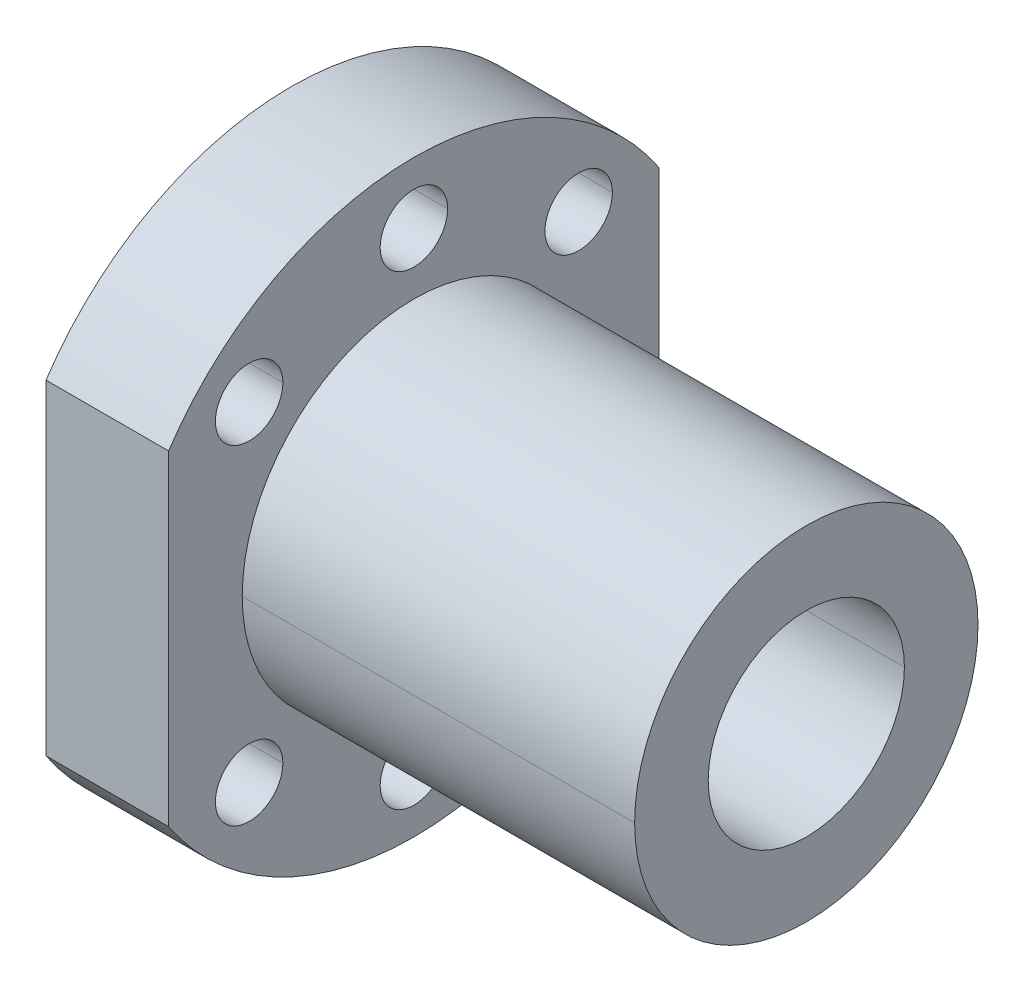
ISO-10303-21;
HEADER;
FILE_DESCRIPTION(('STEP AP214'),'2;1');
FILE_NAME('part.step','',(''),(''),'','','');
FILE_SCHEMA(('AUTOMOTIVE_DESIGN { 1 0 10303 214 1 1 1 1 }'));
ENDSEC;
DATA;
#1=APPLICATION_CONTEXT('core data for automotive mechanical design processes');
#2=APPLICATION_PROTOCOL_DEFINITION('international standard','automotive_design',2000,#1);
#3=PRODUCT_CONTEXT('',#1,'mechanical');
#4=PRODUCT('Part','Part','',(#3));
#5=PRODUCT_RELATED_PRODUCT_CATEGORY('part','',(#4));
#6=PRODUCT_DEFINITION_FORMATION('','',#4);
#7=PRODUCT_DEFINITION_CONTEXT('part definition',#1,'design');
#8=PRODUCT_DEFINITION('design','',#6,#7);
#9=PRODUCT_DEFINITION_SHAPE('','',#8);
#10=(LENGTH_UNIT() NAMED_UNIT(*) SI_UNIT(.MILLI.,.METRE.));
#11=(NAMED_UNIT(*) PLANE_ANGLE_UNIT() SI_UNIT($,.RADIAN.));
#12=(NAMED_UNIT(*) SI_UNIT($,.STERADIAN.) SOLID_ANGLE_UNIT());
#13=UNCERTAINTY_MEASURE_WITH_UNIT(LENGTH_MEASURE(1.E-05),#10,'distance_accuracy_value','');
#14=(GEOMETRIC_REPRESENTATION_CONTEXT(3) GLOBAL_UNCERTAINTY_ASSIGNED_CONTEXT((#13)) GLOBAL_UNIT_ASSIGNED_CONTEXT((#10,
#11,#12)) REPRESENTATION_CONTEXT('',''));
#15=CARTESIAN_POINT('',(0.,0.,0.));
#16=DIRECTION('',(0.,0.,1.));
#17=DIRECTION('',(1.,0.,0.));
#18=AXIS2_PLACEMENT_3D('',#15,#16,#17);
#19=CARTESIAN_POINT('',(42.,0.,0.));
#20=DIRECTION('',(1.,0.,0.));
#21=DIRECTION('',(0.,1.,0.));
#22=AXIS2_PLACEMENT_3D('',#19,#20,#21);
#23=PLANE('',#22);
#24=CARTESIAN_POINT('',(42.,0.,0.));
#25=DIRECTION('',(1.,0.,0.));
#26=DIRECTION('',(0.,0.,-1.));
#27=AXIS2_PLACEMENT_3D('',#24,#25,#26);
#28=CIRCLE('',#27,8.);
#29=CARTESIAN_POINT('',(42.,0.,-8.));
#30=VERTEX_POINT('',#29);
#31=CARTESIAN_POINT('',(42.,0.,8.));
#32=VERTEX_POINT('',#31);
#33=EDGE_CURVE('E9',#30,#32,#28,.T.);
#34=ORIENTED_EDGE('',*,*,#33,.F.);
#35=CARTESIAN_POINT('',(42.,0.,0.));
#36=DIRECTION('',(1.,0.,0.));
#37=DIRECTION('',(0.,0.,-1.));
#38=AXIS2_PLACEMENT_3D('',#35,#36,#37);
#39=CIRCLE('',#38,8.);
#40=EDGE_CURVE('E436',#32,#30,#39,.T.);
#41=ORIENTED_EDGE('',*,*,#40,.F.);
#42=EDGE_LOOP('',(#34,#41));
#43=FACE_BOUND('',#42,.T.);
#44=CARTESIAN_POINT('',(42.,0.,0.));
#45=DIRECTION('',(1.,0.,0.));
#46=DIRECTION('',(0.,0.,-1.));
#47=AXIS2_PLACEMENT_3D('',#44,#45,#46);
#48=CIRCLE('',#47,14.);
#49=CARTESIAN_POINT('',(42.,0.,14.));
#50=VERTEX_POINT('',#49);
#51=CARTESIAN_POINT('',(42.,0.,-14.));
#52=VERTEX_POINT('',#51);
#53=EDGE_CURVE('E317',#50,#52,#48,.T.);
#54=ORIENTED_EDGE('',*,*,#53,.T.);
#55=CARTESIAN_POINT('',(42.,0.,0.));
#56=DIRECTION('',(1.,0.,0.));
#57=DIRECTION('',(0.,0.,-1.));
#58=AXIS2_PLACEMENT_3D('',#55,#56,#57);
#59=CIRCLE('',#58,14.);
#60=EDGE_CURVE('E353',#52,#50,#59,.T.);
#61=ORIENTED_EDGE('',*,*,#60,.T.);
#62=EDGE_LOOP('',(#54,#61));
#63=FACE_BOUND('',#62,.T.);
#64=ADVANCED_FACE('F14',(#43,#63),#23,.T.);
#65=CARTESIAN_POINT('',(0.,0.,0.));
#66=DIRECTION('',(1.,0.,0.));
#67=DIRECTION('',(0.,0.,-1.));
#68=AXIS2_PLACEMENT_3D('',#65,#66,#67);
#69=CYLINDRICAL_SURFACE('',#68,8.);
#70=DIRECTION('',(1.,0.,0.));
#71=VECTOR('',#70,1.);
#72=CARTESIAN_POINT('',(0.,0.,8.));
#73=LINE('',#72,#71);
#74=CARTESIAN_POINT('',(0.,0.,8.));
#75=VERTEX_POINT('',#74);
#76=EDGE_CURVE('E301',#75,#32,#73,.T.);
#77=ORIENTED_EDGE('',*,*,#76,.F.);
#78=CARTESIAN_POINT('',(0.,0.,0.));
#79=DIRECTION('',(1.,0.,0.));
#80=DIRECTION('',(0.,0.,-1.));
#81=AXIS2_PLACEMENT_3D('',#78,#79,#80);
#82=CIRCLE('',#81,8.);
#83=CARTESIAN_POINT('',(0.,0.,-8.));
#84=VERTEX_POINT('',#83);
#85=EDGE_CURVE('E354',#84,#75,#82,.T.);
#86=ORIENTED_EDGE('',*,*,#85,.F.);
#87=DIRECTION('',(1.,0.,0.));
#88=VECTOR('',#87,1.);
#89=CARTESIAN_POINT('',(0.,0.,-8.));
#90=LINE('',#89,#88);
#91=EDGE_CURVE('E24',#84,#30,#90,.T.);
#92=ORIENTED_EDGE('',*,*,#91,.T.);
#93=ORIENTED_EDGE('',*,*,#33,.T.);
#94=EDGE_LOOP('',(#77,#86,#92,#93));
#95=FACE_BOUND('',#94,.T.);
#96=ADVANCED_FACE('F468',(#95),#69,.F.);
#97=CARTESIAN_POINT('',(0.,0.,0.));
#98=DIRECTION('',(1.,0.,0.));
#99=DIRECTION('',(0.,0.,-1.));
#100=AXIS2_PLACEMENT_3D('',#97,#98,#99);
#101=CYLINDRICAL_SURFACE('',#100,8.);
#102=CARTESIAN_POINT('',(0.,0.,0.));
#103=DIRECTION('',(1.,0.,0.));
#104=DIRECTION('',(0.,0.,-1.));
#105=AXIS2_PLACEMENT_3D('',#102,#103,#104);
#106=CIRCLE('',#105,8.);
#107=EDGE_CURVE('E358',#75,#84,#106,.T.);
#108=ORIENTED_EDGE('',*,*,#107,.F.);
#109=ORIENTED_EDGE('',*,*,#76,.T.);
#110=ORIENTED_EDGE('',*,*,#40,.T.);
#111=ORIENTED_EDGE('',*,*,#91,.F.);
#112=EDGE_LOOP('',(#108,#109,#110,#111));
#113=FACE_BOUND('',#112,.T.);
#114=ADVANCED_FACE('F466',(#113),#101,.F.);
#115=CARTESIAN_POINT('',(0.,-13.4350288425445,13.4350288425443));
#116=DIRECTION('',(1.,0.,0.));
#117=DIRECTION('',(0.,0.,-1.));
#118=AXIS2_PLACEMENT_3D('',#115,#116,#117);
#119=CYLINDRICAL_SURFACE('',#118,2.75);
#120=DIRECTION('',(1.,0.,0.));
#121=VECTOR('',#120,1.);
#122=CARTESIAN_POINT('',(0.,-13.4350288425445,16.1850288425444));
#123=LINE('',#122,#121);
#124=CARTESIAN_POINT('',(0.,-13.4350288425445,16.1850288425444));
#125=VERTEX_POINT('',#124);
#126=CARTESIAN_POINT('',(10.,-13.4350288425445,16.1850288425444));
#127=VERTEX_POINT('',#126);
#128=EDGE_CURVE('E207',#125,#127,#123,.T.);
#129=ORIENTED_EDGE('',*,*,#128,.F.);
#130=CARTESIAN_POINT('',(0.,-13.4350288425445,13.4350288425443));
#131=DIRECTION('',(1.,0.,0.));
#132=DIRECTION('',(0.,0.,-1.));
#133=AXIS2_PLACEMENT_3D('',#130,#131,#132);
#134=CIRCLE('',#133,2.75);
#135=CARTESIAN_POINT('',(0.,-13.4350288425445,10.6850288425443));
#136=VERTEX_POINT('',#135);
#137=EDGE_CURVE('E286',#136,#125,#134,.T.);
#138=ORIENTED_EDGE('',*,*,#137,.F.);
#139=DIRECTION('',(1.,0.,0.));
#140=VECTOR('',#139,1.);
#141=CARTESIAN_POINT('',(0.,-13.4350288425445,10.6850288425443));
#142=LINE('',#141,#140);
#143=CARTESIAN_POINT('',(10.,-13.4350288425445,10.6850288425443));
#144=VERTEX_POINT('',#143);
#145=EDGE_CURVE('E198',#136,#144,#142,.T.);
#146=ORIENTED_EDGE('',*,*,#145,.T.);
#147=CARTESIAN_POINT('',(10.,-13.4350288425445,13.4350288425443));
#148=DIRECTION('',(1.,0.,0.));
#149=DIRECTION('',(0.,0.,-1.));
#150=AXIS2_PLACEMENT_3D('',#147,#148,#149);
#151=CIRCLE('',#150,2.75);
#152=EDGE_CURVE('E247',#144,#127,#151,.T.);
#153=ORIENTED_EDGE('',*,*,#152,.T.);
#154=EDGE_LOOP('',(#129,#138,#146,#153));
#155=FACE_BOUND('',#154,.T.);
#156=ADVANCED_FACE('F496',(#155),#119,.F.);
#157=CARTESIAN_POINT('',(0.,-13.4350288425445,13.4350288425443));
#158=DIRECTION('',(1.,0.,0.));
#159=DIRECTION('',(0.,0.,-1.));
#160=AXIS2_PLACEMENT_3D('',#157,#158,#159);
#161=CYLINDRICAL_SURFACE('',#160,2.75);
#162=CARTESIAN_POINT('',(0.,-13.4350288425445,13.4350288425443));
#163=DIRECTION('',(1.,0.,0.));
#164=DIRECTION('',(0.,0.,-1.));
#165=AXIS2_PLACEMENT_3D('',#162,#163,#164);
#166=CIRCLE('',#165,2.75);
#167=EDGE_CURVE('E372',#125,#136,#166,.T.);
#168=ORIENTED_EDGE('',*,*,#167,.F.);
#169=ORIENTED_EDGE('',*,*,#128,.T.);
#170=CARTESIAN_POINT('',(10.,-13.4350288425445,13.4350288425443));
#171=DIRECTION('',(1.,0.,0.));
#172=DIRECTION('',(0.,0.,-1.));
#173=AXIS2_PLACEMENT_3D('',#170,#171,#172);
#174=CIRCLE('',#173,2.75);
#175=EDGE_CURVE('E283',#127,#144,#174,.T.);
#176=ORIENTED_EDGE('',*,*,#175,.T.);
#177=ORIENTED_EDGE('',*,*,#145,.F.);
#178=EDGE_LOOP('',(#168,#169,#176,#177));
#179=FACE_BOUND('',#178,.T.);
#180=ADVANCED_FACE('F522',(#179),#161,.F.);
#181=CARTESIAN_POINT('',(0.,24.,-20.));
#182=DIRECTION('',(0.,0.,1.));
#183=DIRECTION('',(0.,-1.,0.));
#184=AXIS2_PLACEMENT_3D('',#181,#182,#183);
#185=PLANE('',#184);
#186=DIRECTION('',(0.,-1.,0.));
#187=VECTOR('',#186,1.);
#188=CARTESIAN_POINT('',(10.,0.,-20.));
#189=LINE('',#188,#187);
#190=CARTESIAN_POINT('',(10.,13.2664991614216,-20.));
#191=VERTEX_POINT('',#190);
#192=CARTESIAN_POINT('',(10.,-13.2664991614216,-20.));
#193=VERTEX_POINT('',#192);
#194=EDGE_CURVE('E267',#191,#193,#189,.T.);
#195=ORIENTED_EDGE('',*,*,#194,.T.);
#196=DIRECTION('',(1.,0.,0.));
#197=VECTOR('',#196,1.);
#198=CARTESIAN_POINT('',(10.,-13.2664991614216,-20.));
#199=LINE('',#198,#197);
#200=CARTESIAN_POINT('',(0.,-13.2664991614216,-20.));
#201=VERTEX_POINT('',#200);
#202=EDGE_CURVE('E309',#201,#193,#199,.T.);
#203=ORIENTED_EDGE('',*,*,#202,.F.);
#204=DIRECTION('',(0.,-1.,0.));
#205=VECTOR('',#204,1.);
#206=CARTESIAN_POINT('',(0.,0.,-20.));
#207=LINE('',#206,#205);
#208=CARTESIAN_POINT('',(0.,13.2664991614216,-20.));
#209=VERTEX_POINT('',#208);
#210=EDGE_CURVE('E322',#209,#201,#207,.T.);
#211=ORIENTED_EDGE('',*,*,#210,.F.);
#212=DIRECTION('',(-1.,0.,0.));
#213=VECTOR('',#212,1.);
#214=CARTESIAN_POINT('',(10.,13.2664991614216,-20.));
#215=LINE('',#214,#213);
#216=EDGE_CURVE('E18',#191,#209,#215,.T.);
#217=ORIENTED_EDGE('',*,*,#216,.F.);
#218=EDGE_LOOP('',(#195,#203,#211,#217));
#219=FACE_BOUND('',#218,.T.);
#220=ADVANCED_FACE('F16',(#219),#185,.F.);
#221=CARTESIAN_POINT('',(10.,0.,0.));
#222=DIRECTION('',(-1.,0.,0.));
#223=DIRECTION('',(0.,0.,1.));
#224=AXIS2_PLACEMENT_3D('',#221,#222,#223);
#225=CYLINDRICAL_SURFACE('',#224,24.);
#226=CARTESIAN_POINT('',(0.,0.,0.));
#227=DIRECTION('',(1.,0.,0.));
#228=DIRECTION('',(0.,0.,-1.));
#229=AXIS2_PLACEMENT_3D('',#226,#227,#228);
#230=CIRCLE('',#229,24.);
#231=CARTESIAN_POINT('',(0.,-13.2664991614216,20.));
#232=VERTEX_POINT('',#231);
#233=EDGE_CURVE('E318',#232,#201,#230,.T.);
#234=ORIENTED_EDGE('',*,*,#233,.T.);
#235=ORIENTED_EDGE('',*,*,#202,.T.);
#236=CARTESIAN_POINT('',(10.,0.,0.));
#237=DIRECTION('',(1.,0.,0.));
#238=DIRECTION('',(0.,0.,-1.));
#239=AXIS2_PLACEMENT_3D('',#236,#237,#238);
#240=CIRCLE('',#239,24.);
#241=CARTESIAN_POINT('',(10.,-13.2664991614216,20.));
#242=VERTEX_POINT('',#241);
#243=EDGE_CURVE('E276',#242,#193,#240,.T.);
#244=ORIENTED_EDGE('',*,*,#243,.F.);
#245=DIRECTION('',(-1.,0.,0.));
#246=VECTOR('',#245,1.);
#247=CARTESIAN_POINT('',(10.,-13.2664991614216,20.));
#248=LINE('',#247,#246);
#249=EDGE_CURVE('E125',#242,#232,#248,.T.);
#250=ORIENTED_EDGE('',*,*,#249,.T.);
#251=EDGE_LOOP('',(#234,#235,#244,#250));
#252=FACE_BOUND('',#251,.T.);
#253=ADVANCED_FACE('F497',(#252),#225,.T.);
#254=CARTESIAN_POINT('',(10.,0.,0.));
#255=DIRECTION('',(-1.,0.,0.));
#256=DIRECTION('',(0.,0.,1.));
#257=AXIS2_PLACEMENT_3D('',#254,#255,#256);
#258=CYLINDRICAL_SURFACE('',#257,24.);
#259=CARTESIAN_POINT('',(10.,0.,0.));
#260=DIRECTION('',(1.,0.,0.));
#261=DIRECTION('',(0.,0.,-1.));
#262=AXIS2_PLACEMENT_3D('',#259,#260,#261);
#263=CIRCLE('',#262,24.);
#264=CARTESIAN_POINT('',(10.,13.2664991614216,20.));
#265=VERTEX_POINT('',#264);
#266=EDGE_CURVE('E277',#191,#265,#263,.T.);
#267=ORIENTED_EDGE('',*,*,#266,.F.);
#268=ORIENTED_EDGE('',*,*,#216,.T.);
#269=CARTESIAN_POINT('',(0.,0.,0.));
#270=DIRECTION('',(1.,0.,0.));
#271=DIRECTION('',(0.,0.,-1.));
#272=AXIS2_PLACEMENT_3D('',#269,#270,#271);
#273=CIRCLE('',#272,24.);
#274=CARTESIAN_POINT('',(0.,13.2664991614216,20.));
#275=VERTEX_POINT('',#274);
#276=EDGE_CURVE('E333',#209,#275,#273,.T.);
#277=ORIENTED_EDGE('',*,*,#276,.T.);
#278=DIRECTION('',(1.,0.,0.));
#279=VECTOR('',#278,1.);
#280=CARTESIAN_POINT('',(10.,13.2664991614216,20.));
#281=LINE('',#280,#279);
#282=EDGE_CURVE('E378',#275,#265,#281,.T.);
#283=ORIENTED_EDGE('',*,*,#282,.T.);
#284=EDGE_LOOP('',(#267,#268,#277,#283));
#285=FACE_BOUND('',#284,.T.);
#286=ADVANCED_FACE('F499',(#285),#258,.T.);
#287=CARTESIAN_POINT('',(0.,-19.,0.));
#288=DIRECTION('',(1.,0.,0.));
#289=DIRECTION('',(0.,0.,-1.));
#290=AXIS2_PLACEMENT_3D('',#287,#288,#289);
#291=CYLINDRICAL_SURFACE('',#290,2.75);
#292=DIRECTION('',(1.,0.,0.));
#293=VECTOR('',#292,1.);
#294=CARTESIAN_POINT('',(0.,-19.,2.75));
#295=LINE('',#294,#293);
#296=CARTESIAN_POINT('',(0.,-19.,2.75));
#297=VERTEX_POINT('',#296);
#298=CARTESIAN_POINT('',(10.,-19.,2.75));
#299=VERTEX_POINT('',#298);
#300=EDGE_CURVE('E228',#297,#299,#295,.T.);
#301=ORIENTED_EDGE('',*,*,#300,.F.);
#302=CARTESIAN_POINT('',(0.,-19.,0.));
#303=DIRECTION('',(1.,0.,0.));
#304=DIRECTION('',(0.,0.,-1.));
#305=AXIS2_PLACEMENT_3D('',#302,#303,#304);
#306=CIRCLE('',#305,2.75);
#307=CARTESIAN_POINT('',(0.,-19.,-2.75));
#308=VERTEX_POINT('',#307);
#309=EDGE_CURVE('E287',#308,#297,#306,.T.);
#310=ORIENTED_EDGE('',*,*,#309,.F.);
#311=DIRECTION('',(1.,0.,0.));
#312=VECTOR('',#311,1.);
#313=CARTESIAN_POINT('',(0.,-19.,-2.75));
#314=LINE('',#313,#312);
#315=CARTESIAN_POINT('',(10.,-19.,-2.75));
#316=VERTEX_POINT('',#315);
#317=EDGE_CURVE('E240',#308,#316,#314,.T.);
#318=ORIENTED_EDGE('',*,*,#317,.T.);
#319=CARTESIAN_POINT('',(10.,-19.,0.));
#320=DIRECTION('',(1.,0.,0.));
#321=DIRECTION('',(0.,0.,-1.));
#322=AXIS2_PLACEMENT_3D('',#319,#320,#321);
#323=CIRCLE('',#322,2.75);
#324=EDGE_CURVE('E245',#316,#299,#323,.T.);
#325=ORIENTED_EDGE('',*,*,#324,.T.);
#326=EDGE_LOOP('',(#301,#310,#318,#325));
#327=FACE_BOUND('',#326,.T.);
#328=ADVANCED_FACE('F249',(#327),#291,.F.);
#329=CARTESIAN_POINT('',(0.,-13.4350288425445,-13.4350288425443));
#330=DIRECTION('',(1.,0.,0.));
#331=DIRECTION('',(0.,0.,-1.));
#332=AXIS2_PLACEMENT_3D('',#329,#330,#331);
#333=CYLINDRICAL_SURFACE('',#332,2.75);
#334=CARTESIAN_POINT('',(0.,-13.4350288425445,-13.4350288425443));
#335=DIRECTION('',(1.,0.,0.));
#336=DIRECTION('',(0.,0.,-1.));
#337=AXIS2_PLACEMENT_3D('',#334,#335,#336);
#338=CIRCLE('',#337,2.75);
#339=CARTESIAN_POINT('',(0.,-13.4350288425445,-10.6850288425443));
#340=VERTEX_POINT('',#339);
#341=CARTESIAN_POINT('',(0.,-13.4350288425445,-16.1850288425444));
#342=VERTEX_POINT('',#341);
#343=EDGE_CURVE('E302',#340,#342,#338,.T.);
#344=ORIENTED_EDGE('',*,*,#343,.F.);
#345=DIRECTION('',(1.,0.,0.));
#346=VECTOR('',#345,1.);
#347=CARTESIAN_POINT('',(0.,-13.4350288425445,-10.6850288425443));
#348=LINE('',#347,#346);
#349=CARTESIAN_POINT('',(10.,-13.4350288425445,-10.6850288425443));
#350=VERTEX_POINT('',#349);
#351=EDGE_CURVE('E316',#340,#350,#348,.T.);
#352=ORIENTED_EDGE('',*,*,#351,.T.);
#353=CARTESIAN_POINT('',(10.,-13.4350288425445,-13.4350288425443));
#354=DIRECTION('',(1.,0.,0.));
#355=DIRECTION('',(0.,0.,-1.));
#356=AXIS2_PLACEMENT_3D('',#353,#354,#355);
#357=CIRCLE('',#356,2.75);
#358=CARTESIAN_POINT('',(10.,-13.4350288425445,-16.1850288425444));
#359=VERTEX_POINT('',#358);
#360=EDGE_CURVE('E251',#350,#359,#357,.T.);
#361=ORIENTED_EDGE('',*,*,#360,.T.);
#362=DIRECTION('',(1.,0.,0.));
#363=VECTOR('',#362,1.);
#364=CARTESIAN_POINT('',(0.,-13.4350288425445,-16.1850288425444));
#365=LINE('',#364,#363);
#366=EDGE_CURVE('E109',#342,#359,#365,.T.);
#367=ORIENTED_EDGE('',*,*,#366,.F.);
#368=EDGE_LOOP('',(#344,#352,#361,#367));
#369=FACE_BOUND('',#368,.T.);
#370=ADVANCED_FACE('F489',(#369),#333,.F.);
#371=CARTESIAN_POINT('',(0.,19.,0.));
#372=DIRECTION('',(1.,0.,0.));
#373=DIRECTION('',(0.,0.,-1.));
#374=AXIS2_PLACEMENT_3D('',#371,#372,#373);
#375=CYLINDRICAL_SURFACE('',#374,2.75);
#376=CARTESIAN_POINT('',(0.,19.,0.));
#377=DIRECTION('',(1.,0.,0.));
#378=DIRECTION('',(0.,0.,-1.));
#379=AXIS2_PLACEMENT_3D('',#376,#377,#378);
#380=CIRCLE('',#379,2.75);
#381=CARTESIAN_POINT('',(0.,19.,2.75));
#382=VERTEX_POINT('',#381);
#383=CARTESIAN_POINT('',(0.,19.,-2.75));
#384=VERTEX_POINT('',#383);
#385=EDGE_CURVE('E288',#382,#384,#380,.T.);
#386=ORIENTED_EDGE('',*,*,#385,.F.);
#387=DIRECTION('',(1.,0.,0.));
#388=VECTOR('',#387,1.);
#389=CARTESIAN_POINT('',(0.,19.,2.75));
#390=LINE('',#389,#388);
#391=CARTESIAN_POINT('',(10.,19.,2.75));
#392=VERTEX_POINT('',#391);
#393=EDGE_CURVE('E365',#382,#392,#390,.T.);
#394=ORIENTED_EDGE('',*,*,#393,.T.);
#395=CARTESIAN_POINT('',(10.,19.,0.));
#396=DIRECTION('',(1.,0.,0.));
#397=DIRECTION('',(0.,0.,-1.));
#398=AXIS2_PLACEMENT_3D('',#395,#396,#397);
#399=CIRCLE('',#398,2.75);
#400=CARTESIAN_POINT('',(10.,19.,-2.75));
#401=VERTEX_POINT('',#400);
#402=EDGE_CURVE('E298',#392,#401,#399,.T.);
#403=ORIENTED_EDGE('',*,*,#402,.T.);
#404=DIRECTION('',(1.,0.,0.));
#405=VECTOR('',#404,1.);
#406=CARTESIAN_POINT('',(0.,19.,-2.75));
#407=LINE('',#406,#405);
#408=EDGE_CURVE('E218',#384,#401,#407,.T.);
#409=ORIENTED_EDGE('',*,*,#408,.F.);
#410=EDGE_LOOP('',(#386,#394,#403,#409));
#411=FACE_BOUND('',#410,.T.);
#412=ADVANCED_FACE('F492',(#411),#375,.F.);
#413=CARTESIAN_POINT('',(0.,13.4350288425445,13.4350288425443));
#414=DIRECTION('',(1.,0.,0.));
#415=DIRECTION('',(0.,0.,-1.));
#416=AXIS2_PLACEMENT_3D('',#413,#414,#415);
#417=CYLINDRICAL_SURFACE('',#416,2.75);
#418=DIRECTION('',(1.,0.,0.));
#419=VECTOR('',#418,1.);
#420=CARTESIAN_POINT('',(0.,13.4350288425445,16.1850288425444));
#421=LINE('',#420,#419);
#422=CARTESIAN_POINT('',(0.,13.4350288425445,16.1850288425444));
#423=VERTEX_POINT('',#422);
#424=CARTESIAN_POINT('',(10.,13.4350288425445,16.1850288425444));
#425=VERTEX_POINT('',#424);
#426=EDGE_CURVE('E393',#423,#425,#421,.T.);
#427=ORIENTED_EDGE('',*,*,#426,.F.);
#428=CARTESIAN_POINT('',(0.,13.4350288425445,13.4350288425443));
#429=DIRECTION('',(1.,0.,0.));
#430=DIRECTION('',(0.,0.,-1.));
#431=AXIS2_PLACEMENT_3D('',#428,#429,#430);
#432=CIRCLE('',#431,2.75);
#433=CARTESIAN_POINT('',(0.,13.4350288425445,10.6850288425443));
#434=VERTEX_POINT('',#433);
#435=EDGE_CURVE('E290',#434,#423,#432,.T.);
#436=ORIENTED_EDGE('',*,*,#435,.F.);
#437=DIRECTION('',(1.,0.,0.));
#438=VECTOR('',#437,1.);
#439=CARTESIAN_POINT('',(0.,13.4350288425445,10.6850288425443));
#440=LINE('',#439,#438);
#441=CARTESIAN_POINT('',(10.,13.4350288425445,10.6850288425443));
#442=VERTEX_POINT('',#441);
#443=EDGE_CURVE('E390',#434,#442,#440,.T.);
#444=ORIENTED_EDGE('',*,*,#443,.T.);
#445=CARTESIAN_POINT('',(10.,13.4350288425445,13.4350288425443));
#446=DIRECTION('',(1.,0.,0.));
#447=DIRECTION('',(0.,0.,-1.));
#448=AXIS2_PLACEMENT_3D('',#445,#446,#447);
#449=CIRCLE('',#448,2.75);
#450=EDGE_CURVE('E293',#442,#425,#449,.T.);
#451=ORIENTED_EDGE('',*,*,#450,.T.);
#452=EDGE_LOOP('',(#427,#436,#444,#451));
#453=FACE_BOUND('',#452,.T.);
#454=ADVANCED_FACE('F477',(#453),#417,.F.);
#455=CARTESIAN_POINT('',(0.,13.4350288425445,13.4350288425443));
#456=DIRECTION('',(1.,0.,0.));
#457=DIRECTION('',(0.,0.,-1.));
#458=AXIS2_PLACEMENT_3D('',#455,#456,#457);
#459=CYLINDRICAL_SURFACE('',#458,2.75);
#460=CARTESIAN_POINT('',(0.,13.4350288425445,13.4350288425443));
#461=DIRECTION('',(1.,0.,0.));
#462=DIRECTION('',(0.,0.,-1.));
#463=AXIS2_PLACEMENT_3D('',#460,#461,#462);
#464=CIRCLE('',#463,2.75);
#465=EDGE_CURVE('E262',#423,#434,#464,.T.);
#466=ORIENTED_EDGE('',*,*,#465,.F.);
#467=ORIENTED_EDGE('',*,*,#426,.T.);
#468=CARTESIAN_POINT('',(10.,13.4350288425445,13.4350288425443));
#469=DIRECTION('',(1.,0.,0.));
#470=DIRECTION('',(0.,0.,-1.));
#471=AXIS2_PLACEMENT_3D('',#468,#469,#470);
#472=CIRCLE('',#471,2.75);
#473=EDGE_CURVE('E297',#425,#442,#472,.T.);
#474=ORIENTED_EDGE('',*,*,#473,.T.);
#475=ORIENTED_EDGE('',*,*,#443,.F.);
#476=EDGE_LOOP('',(#466,#467,#474,#475));
#477=FACE_BOUND('',#476,.T.);
#478=ADVANCED_FACE('F510',(#477),#459,.F.);
#479=CARTESIAN_POINT('',(0.,24.8623728813561,20.));
#480=DIRECTION('',(0.,0.,-1.));
#481=DIRECTION('',(0.,-1.,0.));
#482=AXIS2_PLACEMENT_3D('',#479,#480,#481);
#483=PLANE('',#482);
#484=DIRECTION('',(0.,1.,0.));
#485=VECTOR('',#484,1.);
#486=CARTESIAN_POINT('',(10.,0.,20.));
#487=LINE('',#486,#485);
#488=EDGE_CURVE('E273',#242,#265,#487,.T.);
#489=ORIENTED_EDGE('',*,*,#488,.T.);
#490=ORIENTED_EDGE('',*,*,#282,.F.);
#491=DIRECTION('',(0.,1.,0.));
#492=VECTOR('',#491,1.);
#493=CARTESIAN_POINT('',(0.,0.,20.));
#494=LINE('',#493,#492);
#495=EDGE_CURVE('E321',#232,#275,#494,.T.);
#496=ORIENTED_EDGE('',*,*,#495,.F.);
#497=ORIENTED_EDGE('',*,*,#249,.F.);
#498=EDGE_LOOP('',(#489,#490,#496,#497));
#499=FACE_BOUND('',#498,.T.);
#500=ADVANCED_FACE('F486',(#499),#483,.F.);
#501=CARTESIAN_POINT('',(42.,0.,0.));
#502=DIRECTION('',(-1.,0.,0.));
#503=DIRECTION('',(0.,0.,1.));
#504=AXIS2_PLACEMENT_3D('',#501,#502,#503);
#505=CYLINDRICAL_SURFACE('',#504,14.);
#506=ORIENTED_EDGE('',*,*,#60,.F.);
#507=DIRECTION('',(-1.,0.,0.));
#508=VECTOR('',#507,1.);
#509=CARTESIAN_POINT('',(42.,0.,-14.));
#510=LINE('',#509,#508);
#511=CARTESIAN_POINT('',(10.,0.,-14.));
#512=VERTEX_POINT('',#511);
#513=EDGE_CURVE('E361',#52,#512,#510,.T.);
#514=ORIENTED_EDGE('',*,*,#513,.T.);
#515=CARTESIAN_POINT('',(10.,0.,0.));
#516=DIRECTION('',(1.,0.,0.));
#517=DIRECTION('',(0.,0.,-1.));
#518=AXIS2_PLACEMENT_3D('',#515,#516,#517);
#519=CIRCLE('',#518,14.);
#520=CARTESIAN_POINT('',(10.,0.,14.));
#521=VERTEX_POINT('',#520);
#522=EDGE_CURVE('E384',#512,#521,#519,.T.);
#523=ORIENTED_EDGE('',*,*,#522,.T.);
#524=DIRECTION('',(-1.,0.,0.));
#525=VECTOR('',#524,1.);
#526=CARTESIAN_POINT('',(42.,0.,14.));
#527=LINE('',#526,#525);
#528=EDGE_CURVE('E314',#50,#521,#527,.T.);
#529=ORIENTED_EDGE('',*,*,#528,.F.);
#530=EDGE_LOOP('',(#506,#514,#523,#529));
#531=FACE_BOUND('',#530,.T.);
#532=ADVANCED_FACE('F415',(#531),#505,.T.);
#533=CARTESIAN_POINT('',(0.,-13.4350288425445,-13.4350288425443));
#534=DIRECTION('',(1.,0.,0.));
#535=DIRECTION('',(0.,0.,-1.));
#536=AXIS2_PLACEMENT_3D('',#533,#534,#535);
#537=CYLINDRICAL_SURFACE('',#536,2.75);
#538=ORIENTED_EDGE('',*,*,#351,.F.);
#539=CARTESIAN_POINT('',(0.,-13.4350288425445,-13.4350288425443));
#540=DIRECTION('',(1.,0.,0.));
#541=DIRECTION('',(0.,0.,-1.));
#542=AXIS2_PLACEMENT_3D('',#539,#540,#541);
#543=CIRCLE('',#542,2.75);
#544=EDGE_CURVE('E306',#342,#340,#543,.T.);
#545=ORIENTED_EDGE('',*,*,#544,.F.);
#546=ORIENTED_EDGE('',*,*,#366,.T.);
#547=CARTESIAN_POINT('',(10.,-13.4350288425445,-13.4350288425443));
#548=DIRECTION('',(1.,0.,0.));
#549=DIRECTION('',(0.,0.,-1.));
#550=AXIS2_PLACEMENT_3D('',#547,#548,#549);
#551=CIRCLE('',#550,2.75);
#552=EDGE_CURVE('E258',#359,#350,#551,.T.);
#553=ORIENTED_EDGE('',*,*,#552,.T.);
#554=EDGE_LOOP('',(#538,#545,#546,#553));
#555=FACE_BOUND('',#554,.T.);
#556=ADVANCED_FACE('F485',(#555),#537,.F.);
#557=CARTESIAN_POINT('',(42.,0.,0.));
#558=DIRECTION('',(-1.,0.,0.));
#559=DIRECTION('',(0.,0.,1.));
#560=AXIS2_PLACEMENT_3D('',#557,#558,#559);
#561=CYLINDRICAL_SURFACE('',#560,14.);
#562=ORIENTED_EDGE('',*,*,#513,.F.);
#563=ORIENTED_EDGE('',*,*,#53,.F.);
#564=ORIENTED_EDGE('',*,*,#528,.T.);
#565=CARTESIAN_POINT('',(10.,0.,0.));
#566=DIRECTION('',(1.,0.,0.));
#567=DIRECTION('',(0.,0.,-1.));
#568=AXIS2_PLACEMENT_3D('',#565,#566,#567);
#569=CIRCLE('',#568,14.);
#570=EDGE_CURVE('E313',#521,#512,#569,.T.);
#571=ORIENTED_EDGE('',*,*,#570,.T.);
#572=EDGE_LOOP('',(#562,#563,#564,#571));
#573=FACE_BOUND('',#572,.T.);
#574=ADVANCED_FACE('F410',(#573),#561,.T.);
#575=CARTESIAN_POINT('',(0.,-19.,0.));
#576=DIRECTION('',(1.,0.,0.));
#577=DIRECTION('',(0.,0.,-1.));
#578=AXIS2_PLACEMENT_3D('',#575,#576,#577);
#579=CYLINDRICAL_SURFACE('',#578,2.75);
#580=CARTESIAN_POINT('',(0.,-19.,0.));
#581=DIRECTION('',(1.,0.,0.));
#582=DIRECTION('',(0.,0.,-1.));
#583=AXIS2_PLACEMENT_3D('',#580,#581,#582);
#584=CIRCLE('',#583,2.75);
#585=EDGE_CURVE('E234',#297,#308,#584,.T.);
#586=ORIENTED_EDGE('',*,*,#585,.F.);
#587=ORIENTED_EDGE('',*,*,#300,.T.);
#588=CARTESIAN_POINT('',(10.,-19.,0.));
#589=DIRECTION('',(1.,0.,0.));
#590=DIRECTION('',(0.,0.,-1.));
#591=AXIS2_PLACEMENT_3D('',#588,#589,#590);
#592=CIRCLE('',#591,2.75);
#593=EDGE_CURVE('E231',#299,#316,#592,.T.);
#594=ORIENTED_EDGE('',*,*,#593,.T.);
#595=ORIENTED_EDGE('',*,*,#317,.F.);
#596=EDGE_LOOP('',(#586,#587,#594,#595));
#597=FACE_BOUND('',#596,.T.);
#598=ADVANCED_FACE('F230',(#597),#579,.F.);
#599=CARTESIAN_POINT('',(0.,19.,0.));
#600=DIRECTION('',(1.,0.,0.));
#601=DIRECTION('',(0.,0.,-1.));
#602=AXIS2_PLACEMENT_3D('',#599,#600,#601);
#603=CYLINDRICAL_SURFACE('',#602,2.75);
#604=ORIENTED_EDGE('',*,*,#393,.F.);
#605=CARTESIAN_POINT('',(0.,19.,0.));
#606=DIRECTION('',(1.,0.,0.));
#607=DIRECTION('',(0.,0.,-1.));
#608=AXIS2_PLACEMENT_3D('',#605,#606,#607);
#609=CIRCLE('',#608,2.75);
#610=EDGE_CURVE('E291',#384,#382,#609,.T.);
#611=ORIENTED_EDGE('',*,*,#610,.F.);
#612=ORIENTED_EDGE('',*,*,#408,.T.);
#613=CARTESIAN_POINT('',(10.,19.,0.));
#614=DIRECTION('',(1.,0.,0.));
#615=DIRECTION('',(0.,0.,-1.));
#616=AXIS2_PLACEMENT_3D('',#613,#614,#615);
#617=CIRCLE('',#616,2.75);
#618=EDGE_CURVE('E282',#401,#392,#617,.T.);
#619=ORIENTED_EDGE('',*,*,#618,.T.);
#620=EDGE_LOOP('',(#604,#611,#612,#619));
#621=FACE_BOUND('',#620,.T.);
#622=ADVANCED_FACE('F503',(#621),#603,.F.);
#623=CARTESIAN_POINT('',(0.,0.,0.));
#624=DIRECTION('',(1.,0.,0.));
#625=DIRECTION('',(0.,1.,0.));
#626=AXIS2_PLACEMENT_3D('',#623,#624,#625);
#627=PLANE('',#626);
#628=ORIENTED_EDGE('',*,*,#85,.T.);
#629=ORIENTED_EDGE('',*,*,#107,.T.);
#630=EDGE_LOOP('',(#628,#629));
#631=FACE_BOUND('',#630,.T.);
#632=ORIENTED_EDGE('',*,*,#435,.T.);
#633=ORIENTED_EDGE('',*,*,#465,.T.);
#634=EDGE_LOOP('',(#632,#633));
#635=FACE_BOUND('',#634,.T.);
#636=ORIENTED_EDGE('',*,*,#610,.T.);
#637=ORIENTED_EDGE('',*,*,#385,.T.);
#638=EDGE_LOOP('',(#636,#637));
#639=FACE_BOUND('',#638,.T.);
#640=CARTESIAN_POINT('',(0.,13.4350288425445,-13.4350288425443));
#641=DIRECTION('',(1.,0.,0.));
#642=DIRECTION('',(0.,0.,-1.));
#643=AXIS2_PLACEMENT_3D('',#640,#641,#642);
#644=CIRCLE('',#643,2.75);
#645=CARTESIAN_POINT('',(0.,13.4350288425445,-16.1850288425444));
#646=VERTEX_POINT('',#645);
#647=CARTESIAN_POINT('',(0.,13.4350288425445,-10.6850288425443));
#648=VERTEX_POINT('',#647);
#649=EDGE_CURVE('E272',#646,#648,#644,.T.);
#650=ORIENTED_EDGE('',*,*,#649,.T.);
#651=CARTESIAN_POINT('',(0.,13.4350288425445,-13.4350288425443));
#652=DIRECTION('',(1.,0.,0.));
#653=DIRECTION('',(0.,0.,-1.));
#654=AXIS2_PLACEMENT_3D('',#651,#652,#653);
#655=CIRCLE('',#654,2.75);
#656=EDGE_CURVE('E344',#648,#646,#655,.T.);
#657=ORIENTED_EDGE('',*,*,#656,.T.);
#658=EDGE_LOOP('',(#650,#657));
#659=FACE_BOUND('',#658,.T.);
#660=ORIENTED_EDGE('',*,*,#137,.T.);
#661=ORIENTED_EDGE('',*,*,#167,.T.);
#662=EDGE_LOOP('',(#660,#661));
#663=FACE_BOUND('',#662,.T.);
#664=ORIENTED_EDGE('',*,*,#309,.T.);
#665=ORIENTED_EDGE('',*,*,#585,.T.);
#666=EDGE_LOOP('',(#664,#665));
#667=FACE_BOUND('',#666,.T.);
#668=ORIENTED_EDGE('',*,*,#544,.T.);
#669=ORIENTED_EDGE('',*,*,#343,.T.);
#670=EDGE_LOOP('',(#668,#669));
#671=FACE_BOUND('',#670,.T.);
#672=ORIENTED_EDGE('',*,*,#276,.F.);
#673=ORIENTED_EDGE('',*,*,#210,.T.);
#674=ORIENTED_EDGE('',*,*,#233,.F.);
#675=ORIENTED_EDGE('',*,*,#495,.T.);
#676=EDGE_LOOP('',(#672,#673,#674,#675));
#677=FACE_BOUND('',#676,.T.);
#678=ADVANCED_FACE('F506',(#631,#635,#639,#659,#663,#667,#671,#677),#627,.F.);
#679=CARTESIAN_POINT('',(0.,13.4350288425445,-13.4350288425443));
#680=DIRECTION('',(1.,0.,0.));
#681=DIRECTION('',(0.,0.,-1.));
#682=AXIS2_PLACEMENT_3D('',#679,#680,#681);
#683=CYLINDRICAL_SURFACE('',#682,2.75);
#684=ORIENTED_EDGE('',*,*,#656,.F.);
#685=DIRECTION('',(1.,0.,0.));
#686=VECTOR('',#685,1.);
#687=CARTESIAN_POINT('',(0.,13.4350288425445,-10.6850288425443));
#688=LINE('',#687,#686);
#689=CARTESIAN_POINT('',(10.,13.4350288425445,-10.6850288425443));
#690=VERTEX_POINT('',#689);
#691=EDGE_CURVE('E348',#648,#690,#688,.T.);
#692=ORIENTED_EDGE('',*,*,#691,.T.);
#693=CARTESIAN_POINT('',(10.,13.4350288425445,-13.4350288425443));
#694=DIRECTION('',(1.,0.,0.));
#695=DIRECTION('',(0.,0.,-1.));
#696=AXIS2_PLACEMENT_3D('',#693,#694,#695);
#697=CIRCLE('',#696,2.75);
#698=CARTESIAN_POINT('',(10.,13.4350288425445,-16.1850288425444));
#699=VERTEX_POINT('',#698);
#700=EDGE_CURVE('E278',#690,#699,#697,.T.);
#701=ORIENTED_EDGE('',*,*,#700,.T.);
#702=DIRECTION('',(1.,0.,0.));
#703=VECTOR('',#702,1.);
#704=CARTESIAN_POINT('',(0.,13.4350288425445,-16.1850288425444));
#705=LINE('',#704,#703);
#706=EDGE_CURVE('E268',#646,#699,#705,.T.);
#707=ORIENTED_EDGE('',*,*,#706,.F.);
#708=EDGE_LOOP('',(#684,#692,#701,#707));
#709=FACE_BOUND('',#708,.T.);
#710=ADVANCED_FACE('F482',(#709),#683,.F.);
#711=CARTESIAN_POINT('',(10.,0.,0.));
#712=DIRECTION('',(1.,0.,0.));
#713=DIRECTION('',(0.,1.,0.));
#714=AXIS2_PLACEMENT_3D('',#711,#712,#713);
#715=PLANE('',#714);
#716=ORIENTED_EDGE('',*,*,#570,.F.);
#717=ORIENTED_EDGE('',*,*,#522,.F.);
#718=EDGE_LOOP('',(#716,#717));
#719=FACE_BOUND('',#718,.T.);
#720=ORIENTED_EDGE('',*,*,#450,.F.);
#721=ORIENTED_EDGE('',*,*,#473,.F.);
#722=EDGE_LOOP('',(#720,#721));
#723=FACE_BOUND('',#722,.T.);
#724=ORIENTED_EDGE('',*,*,#618,.F.);
#725=ORIENTED_EDGE('',*,*,#402,.F.);
#726=EDGE_LOOP('',(#724,#725));
#727=FACE_BOUND('',#726,.T.);
#728=CARTESIAN_POINT('',(10.,13.4350288425445,-13.4350288425443));
#729=DIRECTION('',(1.,0.,0.));
#730=DIRECTION('',(0.,0.,-1.));
#731=AXIS2_PLACEMENT_3D('',#728,#729,#730);
#732=CIRCLE('',#731,2.75);
#733=EDGE_CURVE('E264',#699,#690,#732,.T.);
#734=ORIENTED_EDGE('',*,*,#733,.F.);
#735=ORIENTED_EDGE('',*,*,#700,.F.);
#736=EDGE_LOOP('',(#734,#735));
#737=FACE_BOUND('',#736,.T.);
#738=ORIENTED_EDGE('',*,*,#152,.F.);
#739=ORIENTED_EDGE('',*,*,#175,.F.);
#740=EDGE_LOOP('',(#738,#739));
#741=FACE_BOUND('',#740,.T.);
#742=ORIENTED_EDGE('',*,*,#324,.F.);
#743=ORIENTED_EDGE('',*,*,#593,.F.);
#744=EDGE_LOOP('',(#742,#743));
#745=FACE_BOUND('',#744,.T.);
#746=ORIENTED_EDGE('',*,*,#552,.F.);
#747=ORIENTED_EDGE('',*,*,#360,.F.);
#748=EDGE_LOOP('',(#746,#747));
#749=FACE_BOUND('',#748,.T.);
#750=ORIENTED_EDGE('',*,*,#194,.F.);
#751=ORIENTED_EDGE('',*,*,#266,.T.);
#752=ORIENTED_EDGE('',*,*,#488,.F.);
#753=ORIENTED_EDGE('',*,*,#243,.T.);
#754=EDGE_LOOP('',(#750,#751,#752,#753));
#755=FACE_BOUND('',#754,.T.);
#756=ADVANCED_FACE('F243',(#719,#723,#727,#737,#741,#745,#749,#755),#715,.T.);
#757=CARTESIAN_POINT('',(0.,13.4350288425445,-13.4350288425443));
#758=DIRECTION('',(1.,0.,0.));
#759=DIRECTION('',(0.,0.,-1.));
#760=AXIS2_PLACEMENT_3D('',#757,#758,#759);
#761=CYLINDRICAL_SURFACE('',#760,2.75);
#762=ORIENTED_EDGE('',*,*,#691,.F.);
#763=ORIENTED_EDGE('',*,*,#649,.F.);
#764=ORIENTED_EDGE('',*,*,#706,.T.);
#765=ORIENTED_EDGE('',*,*,#733,.T.);
#766=EDGE_LOOP('',(#762,#763,#764,#765));
#767=FACE_BOUND('',#766,.T.);
#768=ADVANCED_FACE('F481',(#767),#761,.F.);
#769=CLOSED_SHELL('',(#64,#96,#114,#156,#180,#220,#253,#286,#328,#370,#412,#454,#478,#500,#532,
#556,#574,#598,#622,#678,#710,#756,#768));
#770=MANIFOLD_SOLID_BREP('B1',#769);
#771=ADVANCED_BREP_SHAPE_REPRESENTATION('',(#18,#770),#14);
#772=SHAPE_DEFINITION_REPRESENTATION(#9,#771);
ENDSEC;
END-ISO-10303-21;
